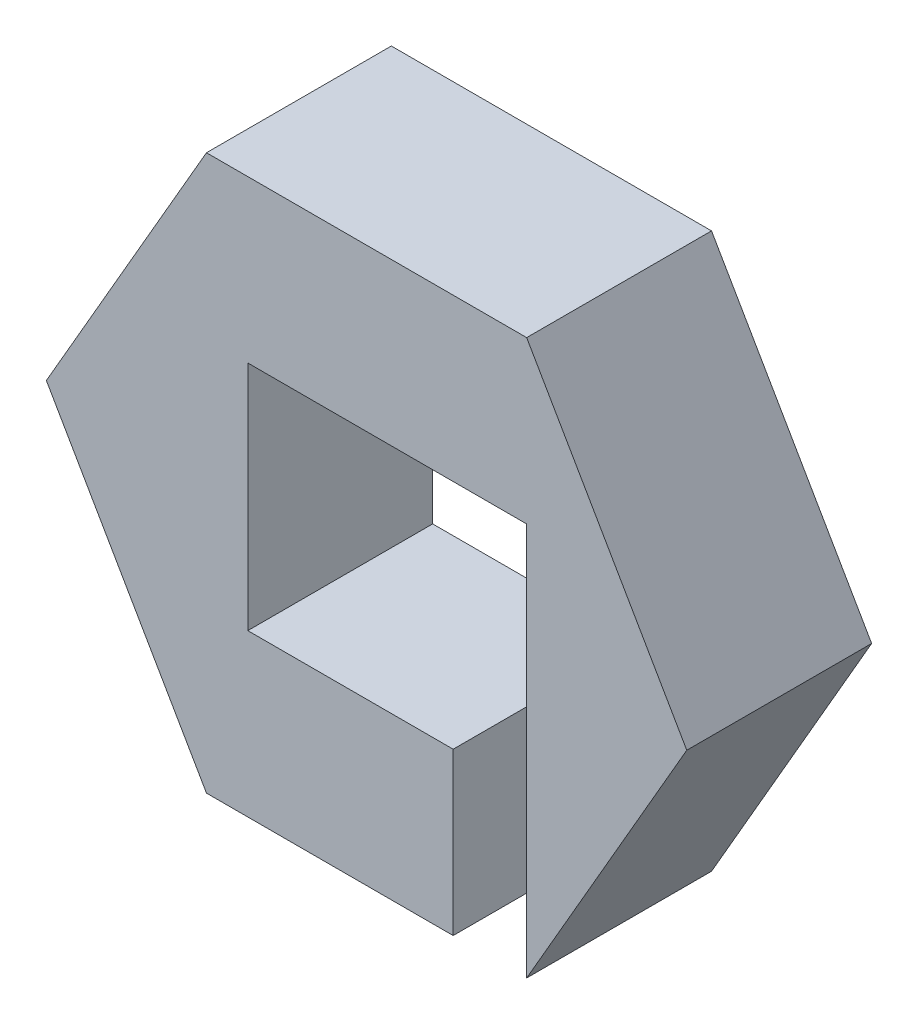
ISO-10303-21;
HEADER;
FILE_DESCRIPTION(('STEP AP214'),'2;1');
FILE_NAME('part.step','',(''),(''),'','','');
FILE_SCHEMA(('AUTOMOTIVE_DESIGN { 1 0 10303 214 1 1 1 1 }'));
ENDSEC;
DATA;
#1=APPLICATION_CONTEXT('core data for automotive mechanical design processes');
#2=APPLICATION_PROTOCOL_DEFINITION('international standard','automotive_design',2000,#1);
#3=PRODUCT_CONTEXT('',#1,'mechanical');
#4=PRODUCT('Part','Part','',(#3));
#5=PRODUCT_RELATED_PRODUCT_CATEGORY('part','',(#4));
#6=PRODUCT_DEFINITION_FORMATION('','',#4);
#7=PRODUCT_DEFINITION_CONTEXT('part definition',#1,'design');
#8=PRODUCT_DEFINITION('design','',#6,#7);
#9=PRODUCT_DEFINITION_SHAPE('','',#8);
#10=(LENGTH_UNIT() NAMED_UNIT(*) SI_UNIT(.MILLI.,.METRE.));
#11=(NAMED_UNIT(*) PLANE_ANGLE_UNIT() SI_UNIT($,.RADIAN.));
#12=(NAMED_UNIT(*) SI_UNIT($,.STERADIAN.) SOLID_ANGLE_UNIT());
#13=UNCERTAINTY_MEASURE_WITH_UNIT(LENGTH_MEASURE(1.E-05),#10,'distance_accuracy_value','');
#14=(GEOMETRIC_REPRESENTATION_CONTEXT(3) GLOBAL_UNCERTAINTY_ASSIGNED_CONTEXT((#13)) GLOBAL_UNIT_ASSIGNED_CONTEXT((#10,
#11,#12)) REPRESENTATION_CONTEXT('',''));
#15=CARTESIAN_POINT('',(0.,0.,0.));
#16=DIRECTION('',(0.,0.,1.));
#17=DIRECTION('',(1.,0.,0.));
#18=AXIS2_PLACEMENT_3D('',#15,#16,#17);
#19=CARTESIAN_POINT('',(8.66025403784439,-15.,10.));
#20=DIRECTION('',(-0.866025403784439,0.5,0.));
#21=DIRECTION('',(-0.5,-0.866025403784439,0.));
#22=AXIS2_PLACEMENT_3D('',#19,#20,#21);
#23=PLANE('',#22);
#24=DIRECTION('',(0.5,0.866025403784439,0.));
#25=VECTOR('',#24,1.);
#26=CARTESIAN_POINT('',(8.66025403784439,-15.,0.));
#27=LINE('',#26,#25);
#28=CARTESIAN_POINT('',(8.66025403784439,-15.,0.));
#29=VERTEX_POINT('',#28);
#30=CARTESIAN_POINT('',(17.3205080756888,0.,0.));
#31=VERTEX_POINT('',#30);
#32=EDGE_CURVE('E163',#29,#31,#27,.T.);
#33=ORIENTED_EDGE('',*,*,#32,.T.);
#34=DIRECTION('',(0.,0.,-1.));
#35=VECTOR('',#34,1.);
#36=CARTESIAN_POINT('',(17.3205080756888,0.,10.));
#37=LINE('',#36,#35);
#38=CARTESIAN_POINT('',(17.3205080756888,0.,10.));
#39=VERTEX_POINT('',#38);
#40=EDGE_CURVE('E11',#39,#31,#37,.T.);
#41=ORIENTED_EDGE('',*,*,#40,.F.);
#42=DIRECTION('',(0.5,0.866025403784439,0.));
#43=VECTOR('',#42,1.);
#44=CARTESIAN_POINT('',(8.66025403784439,-15.,10.));
#45=LINE('',#44,#43);
#46=CARTESIAN_POINT('',(8.66025403784439,-15.,10.));
#47=VERTEX_POINT('',#46);
#48=EDGE_CURVE('E165',#47,#39,#45,.T.);
#49=ORIENTED_EDGE('',*,*,#48,.F.);
#50=DIRECTION('',(0.,0.,-1.));
#51=VECTOR('',#50,1.);
#52=CARTESIAN_POINT('',(8.66025403784439,-15.,10.));
#53=LINE('',#52,#51);
#54=EDGE_CURVE('E137',#47,#29,#53,.T.);
#55=ORIENTED_EDGE('',*,*,#54,.T.);
#56=EDGE_LOOP('',(#33,#41,#49,#55));
#57=FACE_BOUND('',#56,.T.);
#58=ADVANCED_FACE('F33',(#57),#23,.F.);
#59=CARTESIAN_POINT('',(17.3205080756888,0.,10.));
#60=DIRECTION('',(-0.866025403784438,-0.5,0.));
#61=DIRECTION('',(0.5,-0.866025403784439,0.));
#62=AXIS2_PLACEMENT_3D('',#59,#60,#61);
#63=PLANE('',#62);
#64=DIRECTION('',(-0.5,0.866025403784438,0.));
#65=VECTOR('',#64,1.);
#66=CARTESIAN_POINT('',(17.3205080756888,0.,0.));
#67=LINE('',#66,#65);
#68=CARTESIAN_POINT('',(8.66025403784439,15.,0.));
#69=VERTEX_POINT('',#68);
#70=EDGE_CURVE('E181',#31,#69,#67,.T.);
#71=ORIENTED_EDGE('',*,*,#70,.T.);
#72=DIRECTION('',(0.,0.,-1.));
#73=VECTOR('',#72,1.);
#74=CARTESIAN_POINT('',(8.66025403784439,15.,10.));
#75=LINE('',#74,#73);
#76=CARTESIAN_POINT('',(8.66025403784439,15.,10.));
#77=VERTEX_POINT('',#76);
#78=EDGE_CURVE('E40',#77,#69,#75,.T.);
#79=ORIENTED_EDGE('',*,*,#78,.F.);
#80=DIRECTION('',(-0.5,0.866025403784438,0.));
#81=VECTOR('',#80,1.);
#82=CARTESIAN_POINT('',(17.3205080756888,0.,10.));
#83=LINE('',#82,#81);
#84=EDGE_CURVE('E167',#39,#77,#83,.T.);
#85=ORIENTED_EDGE('',*,*,#84,.F.);
#86=ORIENTED_EDGE('',*,*,#40,.T.);
#87=EDGE_LOOP('',(#71,#79,#85,#86));
#88=FACE_BOUND('',#87,.T.);
#89=ADVANCED_FACE('F223',(#88),#63,.F.);
#90=CARTESIAN_POINT('',(8.66025403784439,15.,10.));
#91=DIRECTION('',(0.,-1.,0.));
#92=DIRECTION('',(0.,0.,-1.));
#93=AXIS2_PLACEMENT_3D('',#90,#91,#92);
#94=PLANE('',#93);
#95=DIRECTION('',(-1.,0.,0.));
#96=VECTOR('',#95,1.);
#97=CARTESIAN_POINT('',(8.66025403784439,15.,0.));
#98=LINE('',#97,#96);
#99=CARTESIAN_POINT('',(-8.66025403784439,15.,0.));
#100=VERTEX_POINT('',#99);
#101=EDGE_CURVE('E183',#69,#100,#98,.T.);
#102=ORIENTED_EDGE('',*,*,#101,.T.);
#103=DIRECTION('',(0.,0.,-1.));
#104=VECTOR('',#103,1.);
#105=CARTESIAN_POINT('',(-8.66025403784439,15.,10.));
#106=LINE('',#105,#104);
#107=CARTESIAN_POINT('',(-8.66025403784439,15.,10.));
#108=VERTEX_POINT('',#107);
#109=EDGE_CURVE('E198',#108,#100,#106,.T.);
#110=ORIENTED_EDGE('',*,*,#109,.F.);
#111=DIRECTION('',(-1.,0.,0.));
#112=VECTOR('',#111,1.);
#113=CARTESIAN_POINT('',(8.66025403784439,15.,10.));
#114=LINE('',#113,#112);
#115=EDGE_CURVE('E170',#77,#108,#114,.T.);
#116=ORIENTED_EDGE('',*,*,#115,.F.);
#117=ORIENTED_EDGE('',*,*,#78,.T.);
#118=EDGE_LOOP('',(#102,#110,#116,#117));
#119=FACE_BOUND('',#118,.T.);
#120=ADVANCED_FACE('F205',(#119),#94,.F.);
#121=CARTESIAN_POINT('',(-8.66025403784439,15.,10.));
#122=DIRECTION('',(0.866025403784439,-0.5,0.));
#123=DIRECTION('',(0.5,0.866025403784439,0.));
#124=AXIS2_PLACEMENT_3D('',#121,#122,#123);
#125=PLANE('',#124);
#126=DIRECTION('',(-0.5,-0.866025403784439,0.));
#127=VECTOR('',#126,1.);
#128=CARTESIAN_POINT('',(-8.66025403784439,15.,0.));
#129=LINE('',#128,#127);
#130=CARTESIAN_POINT('',(-17.3205080756888,0.,0.));
#131=VERTEX_POINT('',#130);
#132=EDGE_CURVE('E185',#100,#131,#129,.T.);
#133=ORIENTED_EDGE('',*,*,#132,.T.);
#134=DIRECTION('',(0.,0.,-1.));
#135=VECTOR('',#134,1.);
#136=CARTESIAN_POINT('',(-17.3205080756888,0.,10.));
#137=LINE('',#136,#135);
#138=CARTESIAN_POINT('',(-17.3205080756888,0.,10.));
#139=VERTEX_POINT('',#138);
#140=EDGE_CURVE('E195',#139,#131,#137,.T.);
#141=ORIENTED_EDGE('',*,*,#140,.F.);
#142=DIRECTION('',(-0.5,-0.866025403784439,0.));
#143=VECTOR('',#142,1.);
#144=CARTESIAN_POINT('',(-8.66025403784439,15.,10.));
#145=LINE('',#144,#143);
#146=EDGE_CURVE('E172',#108,#139,#145,.T.);
#147=ORIENTED_EDGE('',*,*,#146,.F.);
#148=ORIENTED_EDGE('',*,*,#109,.T.);
#149=EDGE_LOOP('',(#133,#141,#147,#148));
#150=FACE_BOUND('',#149,.T.);
#151=ADVANCED_FACE('F215',(#150),#125,.F.);
#152=CARTESIAN_POINT('',(-17.3205080756888,0.,10.));
#153=DIRECTION('',(0.866025403784439,0.5,0.));
#154=DIRECTION('',(-0.5,0.866025403784439,0.));
#155=AXIS2_PLACEMENT_3D('',#152,#153,#154);
#156=PLANE('',#155);
#157=DIRECTION('',(0.5,-0.866025403784439,0.));
#158=VECTOR('',#157,1.);
#159=CARTESIAN_POINT('',(-17.3205080756888,0.,0.));
#160=LINE('',#159,#158);
#161=CARTESIAN_POINT('',(-8.66025403784439,-15.,0.));
#162=VERTEX_POINT('',#161);
#163=EDGE_CURVE('E187',#131,#162,#160,.T.);
#164=ORIENTED_EDGE('',*,*,#163,.T.);
#165=DIRECTION('',(0.,0.,-1.));
#166=VECTOR('',#165,1.);
#167=CARTESIAN_POINT('',(-8.66025403784439,-15.,10.));
#168=LINE('',#167,#166);
#169=CARTESIAN_POINT('',(-8.66025403784439,-15.,10.));
#170=VERTEX_POINT('',#169);
#171=EDGE_CURVE('E192',#170,#162,#168,.T.);
#172=ORIENTED_EDGE('',*,*,#171,.F.);
#173=DIRECTION('',(0.5,-0.866025403784439,0.));
#174=VECTOR('',#173,1.);
#175=CARTESIAN_POINT('',(-17.3205080756888,0.,10.));
#176=LINE('',#175,#174);
#177=EDGE_CURVE('E174',#139,#170,#176,.T.);
#178=ORIENTED_EDGE('',*,*,#177,.F.);
#179=ORIENTED_EDGE('',*,*,#140,.T.);
#180=EDGE_LOOP('',(#164,#172,#178,#179));
#181=FACE_BOUND('',#180,.T.);
#182=ADVANCED_FACE('F219',(#181),#156,.F.);
#183=CARTESIAN_POINT('',(-8.66025403784439,-15.,10.));
#184=DIRECTION('',(0.,1.,0.));
#185=DIRECTION('',(-1.,0.,0.));
#186=AXIS2_PLACEMENT_3D('',#183,#184,#185);
#187=PLANE('',#186);
#188=DIRECTION('',(1.,0.,0.));
#189=VECTOR('',#188,1.);
#190=CARTESIAN_POINT('',(-8.66025403784439,-15.,0.));
#191=LINE('',#190,#189);
#192=CARTESIAN_POINT('',(4.6846808670298,-15.,0.));
#193=VERTEX_POINT('',#192);
#194=EDGE_CURVE('E168',#162,#193,#191,.T.);
#195=ORIENTED_EDGE('',*,*,#194,.T.);
#196=DIRECTION('',(0.,0.,-1.));
#197=VECTOR('',#196,1.);
#198=CARTESIAN_POINT('',(4.6846808670298,-15.,10.));
#199=LINE('',#198,#197);
#200=CARTESIAN_POINT('',(4.6846808670298,-15.,10.));
#201=VERTEX_POINT('',#200);
#202=EDGE_CURVE('E141',#201,#193,#199,.T.);
#203=ORIENTED_EDGE('',*,*,#202,.F.);
#204=DIRECTION('',(1.,0.,0.));
#205=VECTOR('',#204,1.);
#206=CARTESIAN_POINT('',(-8.66025403784439,-15.,10.));
#207=LINE('',#206,#205);
#208=EDGE_CURVE('E176',#170,#201,#207,.T.);
#209=ORIENTED_EDGE('',*,*,#208,.F.);
#210=ORIENTED_EDGE('',*,*,#171,.T.);
#211=EDGE_LOOP('',(#195,#203,#209,#210));
#212=FACE_BOUND('',#211,.T.);
#213=ADVANCED_FACE('F238',(#212),#187,.F.);
#214=CARTESIAN_POINT('',(0.,0.,10.));
#215=DIRECTION('',(0.,0.,1.));
#216=DIRECTION('',(1.,0.,0.));
#217=AXIS2_PLACEMENT_3D('',#214,#215,#216);
#218=PLANE('',#217);
#219=DIRECTION('',(0.,-1.,0.));
#220=VECTOR('',#219,1.);
#221=CARTESIAN_POINT('',(4.6846808670298,6.26947996120281,10.));
#222=LINE('',#221,#220);
#223=CARTESIAN_POINT('',(4.6846808670298,-6.26947996120281,10.));
#224=VERTEX_POINT('',#223);
#225=EDGE_CURVE('E138',#224,#201,#222,.T.);
#226=ORIENTED_EDGE('',*,*,#225,.F.);
#227=DIRECTION('',(1.,0.,0.));
#228=VECTOR('',#227,1.);
#229=CARTESIAN_POINT('',(-6.42390064990243,-6.26947996120281,10.));
#230=LINE('',#229,#228);
#231=CARTESIAN_POINT('',(-6.42390064990243,-6.26947996120281,10.));
#232=VERTEX_POINT('',#231);
#233=EDGE_CURVE('E152',#232,#224,#230,.T.);
#234=ORIENTED_EDGE('',*,*,#233,.F.);
#235=DIRECTION('',(0.,-1.,0.));
#236=VECTOR('',#235,1.);
#237=CARTESIAN_POINT('',(-6.42390064990243,6.26947996120281,10.));
#238=LINE('',#237,#236);
#239=CARTESIAN_POINT('',(-6.42390064990243,6.26947996120281,10.));
#240=VERTEX_POINT('',#239);
#241=EDGE_CURVE('E125',#240,#232,#238,.T.);
#242=ORIENTED_EDGE('',*,*,#241,.F.);
#243=DIRECTION('',(-1.,0.,0.));
#244=VECTOR('',#243,1.);
#245=CARTESIAN_POINT('',(-6.42390064990243,6.26947996120281,10.));
#246=LINE('',#245,#244);
#247=CARTESIAN_POINT('',(8.66025403784439,6.26947996120281,10.));
#248=VERTEX_POINT('',#247);
#249=EDGE_CURVE('E116',#248,#240,#246,.T.);
#250=ORIENTED_EDGE('',*,*,#249,.F.);
#251=DIRECTION('',(0.,-1.,0.));
#252=VECTOR('',#251,1.);
#253=CARTESIAN_POINT('',(8.66025403784439,6.26947996120281,10.));
#254=LINE('',#253,#252);
#255=EDGE_CURVE('E121',#248,#47,#254,.T.);
#256=ORIENTED_EDGE('',*,*,#255,.T.);
#257=ORIENTED_EDGE('',*,*,#48,.T.);
#258=ORIENTED_EDGE('',*,*,#84,.T.);
#259=ORIENTED_EDGE('',*,*,#115,.T.);
#260=ORIENTED_EDGE('',*,*,#146,.T.);
#261=ORIENTED_EDGE('',*,*,#177,.T.);
#262=ORIENTED_EDGE('',*,*,#208,.T.);
#263=EDGE_LOOP('',(#226,#234,#242,#250,#256,#257,#258,#259,#260,#261,#262));
#264=FACE_BOUND('',#263,.T.);
#265=ADVANCED_FACE('F119',(#264),#218,.T.);
#266=CARTESIAN_POINT('',(0.,0.,0.));
#267=DIRECTION('',(0.,0.,1.));
#268=DIRECTION('',(1.,0.,0.));
#269=AXIS2_PLACEMENT_3D('',#266,#267,#268);
#270=PLANE('',#269);
#271=DIRECTION('',(1.,0.,0.));
#272=VECTOR('',#271,1.);
#273=CARTESIAN_POINT('',(-6.42390064990243,-6.26947996120281,0.));
#274=LINE('',#273,#272);
#275=CARTESIAN_POINT('',(-6.42390064990243,-6.26947996120281,0.));
#276=VERTEX_POINT('',#275);
#277=CARTESIAN_POINT('',(4.6846808670298,-6.26947996120281,0.));
#278=VERTEX_POINT('',#277);
#279=EDGE_CURVE('E154',#276,#278,#274,.T.);
#280=ORIENTED_EDGE('',*,*,#279,.T.);
#281=DIRECTION('',(0.,-1.,0.));
#282=VECTOR('',#281,1.);
#283=CARTESIAN_POINT('',(4.6846808670298,6.26947996120281,0.));
#284=LINE('',#283,#282);
#285=EDGE_CURVE('E47',#278,#193,#284,.T.);
#286=ORIENTED_EDGE('',*,*,#285,.T.);
#287=ORIENTED_EDGE('',*,*,#194,.F.);
#288=ORIENTED_EDGE('',*,*,#163,.F.);
#289=ORIENTED_EDGE('',*,*,#132,.F.);
#290=ORIENTED_EDGE('',*,*,#101,.F.);
#291=ORIENTED_EDGE('',*,*,#70,.F.);
#292=ORIENTED_EDGE('',*,*,#32,.F.);
#293=DIRECTION('',(0.,-1.,0.));
#294=VECTOR('',#293,1.);
#295=CARTESIAN_POINT('',(8.66025403784439,6.26947996120281,0.));
#296=LINE('',#295,#294);
#297=CARTESIAN_POINT('',(8.66025403784439,6.26947996120281,0.));
#298=VERTEX_POINT('',#297);
#299=EDGE_CURVE('E145',#298,#29,#296,.T.);
#300=ORIENTED_EDGE('',*,*,#299,.F.);
#301=DIRECTION('',(-1.,0.,0.));
#302=VECTOR('',#301,1.);
#303=CARTESIAN_POINT('',(-6.42390064990243,6.26947996120281,0.));
#304=LINE('',#303,#302);
#305=CARTESIAN_POINT('',(-6.42390064990243,6.26947996120281,0.));
#306=VERTEX_POINT('',#305);
#307=EDGE_CURVE('E55',#298,#306,#304,.T.);
#308=ORIENTED_EDGE('',*,*,#307,.T.);
#309=DIRECTION('',(0.,-1.,0.));
#310=VECTOR('',#309,1.);
#311=CARTESIAN_POINT('',(-6.42390064990243,6.26947996120281,0.));
#312=LINE('',#311,#310);
#313=EDGE_CURVE('E151',#306,#276,#312,.T.);
#314=ORIENTED_EDGE('',*,*,#313,.T.);
#315=EDGE_LOOP('',(#280,#286,#287,#288,#289,#290,#291,#292,#300,#308,#314));
#316=FACE_BOUND('',#315,.T.);
#317=ADVANCED_FACE('F209',(#316),#270,.F.);
#318=CARTESIAN_POINT('',(-6.42390064990243,-6.26947996120281,0.));
#319=DIRECTION('',(0.,-1.,0.));
#320=DIRECTION('',(0.,0.,-1.));
#321=AXIS2_PLACEMENT_3D('',#318,#319,#320);
#322=PLANE('',#321);
#323=ORIENTED_EDGE('',*,*,#233,.T.);
#324=DIRECTION('',(0.,0.,-1.));
#325=VECTOR('',#324,1.);
#326=CARTESIAN_POINT('',(4.6846808670298,-6.26947996120281,0.));
#327=LINE('',#326,#325);
#328=EDGE_CURVE('E130',#224,#278,#327,.T.);
#329=ORIENTED_EDGE('',*,*,#328,.T.);
#330=ORIENTED_EDGE('',*,*,#279,.F.);
#331=DIRECTION('',(0.,0.,1.));
#332=VECTOR('',#331,1.);
#333=CARTESIAN_POINT('',(-6.42390064990243,-6.26947996120281,0.));
#334=LINE('',#333,#332);
#335=EDGE_CURVE('E161',#276,#232,#334,.T.);
#336=ORIENTED_EDGE('',*,*,#335,.T.);
#337=EDGE_LOOP('',(#323,#329,#330,#336));
#338=FACE_BOUND('',#337,.T.);
#339=ADVANCED_FACE('F244',(#338),#322,.F.);
#340=CARTESIAN_POINT('',(-6.42390064990243,6.26947996120281,0.));
#341=DIRECTION('',(-1.,0.,0.));
#342=DIRECTION('',(0.,0.,1.));
#343=AXIS2_PLACEMENT_3D('',#340,#341,#342);
#344=PLANE('',#343);
#345=ORIENTED_EDGE('',*,*,#241,.T.);
#346=ORIENTED_EDGE('',*,*,#335,.F.);
#347=ORIENTED_EDGE('',*,*,#313,.F.);
#348=DIRECTION('',(0.,0.,1.));
#349=VECTOR('',#348,1.);
#350=CARTESIAN_POINT('',(-6.42390064990243,6.26947996120281,0.));
#351=LINE('',#350,#349);
#352=EDGE_CURVE('E156',#306,#240,#351,.T.);
#353=ORIENTED_EDGE('',*,*,#352,.T.);
#354=EDGE_LOOP('',(#345,#346,#347,#353));
#355=FACE_BOUND('',#354,.T.);
#356=ADVANCED_FACE('F250',(#355),#344,.F.);
#357=CARTESIAN_POINT('',(-6.42390064990243,6.26947996120281,0.));
#358=DIRECTION('',(0.,1.,0.));
#359=DIRECTION('',(0.,0.,1.));
#360=AXIS2_PLACEMENT_3D('',#357,#358,#359);
#361=PLANE('',#360);
#362=ORIENTED_EDGE('',*,*,#352,.F.);
#363=ORIENTED_EDGE('',*,*,#307,.F.);
#364=DIRECTION('',(0.,0.,1.));
#365=VECTOR('',#364,1.);
#366=CARTESIAN_POINT('',(8.66025403784439,6.26947996120281,10.));
#367=LINE('',#366,#365);
#368=EDGE_CURVE('E135',#298,#248,#367,.T.);
#369=ORIENTED_EDGE('',*,*,#368,.T.);
#370=ORIENTED_EDGE('',*,*,#249,.T.);
#371=EDGE_LOOP('',(#362,#363,#369,#370));
#372=FACE_BOUND('',#371,.T.);
#373=ADVANCED_FACE('F140',(#372),#361,.F.);
#374=CARTESIAN_POINT('',(4.6846808670298,6.26947996120281,10.));
#375=DIRECTION('',(-1.,0.,0.));
#376=DIRECTION('',(0.,-1.,0.));
#377=AXIS2_PLACEMENT_3D('',#374,#375,#376);
#378=PLANE('',#377);
#379=ORIENTED_EDGE('',*,*,#225,.T.);
#380=ORIENTED_EDGE('',*,*,#202,.T.);
#381=ORIENTED_EDGE('',*,*,#285,.F.);
#382=ORIENTED_EDGE('',*,*,#328,.F.);
#383=EDGE_LOOP('',(#379,#380,#381,#382));
#384=FACE_BOUND('',#383,.T.);
#385=ADVANCED_FACE('F249',(#384),#378,.F.);
#386=CARTESIAN_POINT('',(8.66025403784439,6.26947996120281,10.));
#387=DIRECTION('',(1.,0.,0.));
#388=DIRECTION('',(0.,1.,0.));
#389=AXIS2_PLACEMENT_3D('',#386,#387,#388);
#390=PLANE('',#389);
#391=ORIENTED_EDGE('',*,*,#54,.F.);
#392=ORIENTED_EDGE('',*,*,#255,.F.);
#393=ORIENTED_EDGE('',*,*,#368,.F.);
#394=ORIENTED_EDGE('',*,*,#299,.T.);
#395=EDGE_LOOP('',(#391,#392,#393,#394));
#396=FACE_BOUND('',#395,.T.);
#397=ADVANCED_FACE('F134',(#396),#390,.F.);
#398=CLOSED_SHELL('',(#58,#89,#120,#151,#182,#213,#265,#317,#339,#356,#373,#385,#397));
#399=MANIFOLD_SOLID_BREP('B2',#398);
#400=ADVANCED_BREP_SHAPE_REPRESENTATION('',(#18,#399),#14);
#401=SHAPE_DEFINITION_REPRESENTATION(#9,#400);
ENDSEC;
END-ISO-10303-21;
